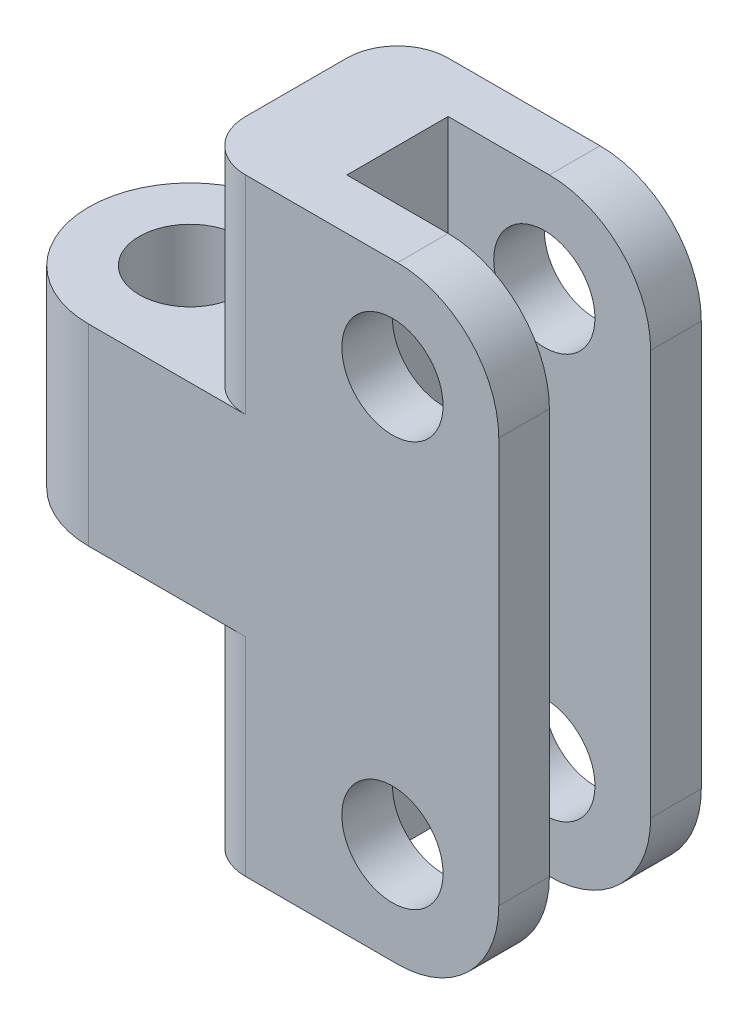
ISO-10303-21;
HEADER;
FILE_DESCRIPTION(('STEP AP214'),'2;1');
FILE_NAME('part.step','',(''),(''),'','','');
FILE_SCHEMA(('AUTOMOTIVE_DESIGN { 1 0 10303 214 1 1 1 1 }'));
ENDSEC;
DATA;
#1=APPLICATION_CONTEXT('core data for automotive mechanical design processes');
#2=APPLICATION_PROTOCOL_DEFINITION('international standard','automotive_design',2000,#1);
#3=PRODUCT_CONTEXT('',#1,'mechanical');
#4=PRODUCT('Part','Part','',(#3));
#5=PRODUCT_RELATED_PRODUCT_CATEGORY('part','',(#4));
#6=PRODUCT_DEFINITION_FORMATION('','',#4);
#7=PRODUCT_DEFINITION_CONTEXT('part definition',#1,'design');
#8=PRODUCT_DEFINITION('design','',#6,#7);
#9=PRODUCT_DEFINITION_SHAPE('','',#8);
#10=(LENGTH_UNIT() NAMED_UNIT(*) SI_UNIT(.MILLI.,.METRE.));
#11=(NAMED_UNIT(*) PLANE_ANGLE_UNIT() SI_UNIT($,.RADIAN.));
#12=(NAMED_UNIT(*) SI_UNIT($,.STERADIAN.) SOLID_ANGLE_UNIT());
#13=UNCERTAINTY_MEASURE_WITH_UNIT(LENGTH_MEASURE(1.E-05),#10,'distance_accuracy_value','');
#14=(GEOMETRIC_REPRESENTATION_CONTEXT(3) GLOBAL_UNCERTAINTY_ASSIGNED_CONTEXT((#13)) GLOBAL_UNIT_ASSIGNED_CONTEXT((#10,
#11,#12)) REPRESENTATION_CONTEXT('',''));
#15=CARTESIAN_POINT('',(0.,0.,0.));
#16=DIRECTION('',(0.,0.,1.));
#17=DIRECTION('',(1.,0.,0.));
#18=AXIS2_PLACEMENT_3D('',#15,#16,#17);
#19=CARTESIAN_POINT('',(0.,9.5,-10.));
#20=DIRECTION('',(0.,0.,-1.));
#21=DIRECTION('',(-1.,0.,0.));
#22=AXIS2_PLACEMENT_3D('',#19,#20,#21);
#23=PLANE('',#22);
#24=CARTESIAN_POINT('',(30.,20.,-10.));
#25=DIRECTION('',(0.,0.,1.));
#26=DIRECTION('',(1.,0.,0.));
#27=AXIS2_PLACEMENT_3D('',#24,#25,#26);
#28=CIRCLE('',#27,5.);
#29=CARTESIAN_POINT('',(35.,20.,-10.));
#30=VERTEX_POINT('',#29);
#31=EDGE_CURVE('E269',#30,#30,#28,.T.);
#32=ORIENTED_EDGE('',*,*,#31,.T.);
#33=EDGE_LOOP('',(#32));
#34=FACE_BOUND('',#33,.T.);
#35=CARTESIAN_POINT('',(30.,-20.,-10.));
#36=DIRECTION('',(0.,0.,1.));
#37=DIRECTION('',(1.,0.,0.));
#38=AXIS2_PLACEMENT_3D('',#35,#36,#37);
#39=CIRCLE('',#38,5.);
#40=CARTESIAN_POINT('',(35.,-20.,-10.));
#41=VERTEX_POINT('',#40);
#42=EDGE_CURVE('E633',#41,#41,#39,.T.);
#43=ORIENTED_EDGE('',*,*,#42,.T.);
#44=EDGE_LOOP('',(#43));
#45=FACE_BOUND('',#44,.T.);
#46=DIRECTION('',(1.,0.,0.));
#47=VECTOR('',#46,1.);
#48=CARTESIAN_POINT('',(0.,-30.,-10.));
#49=LINE('',#48,#47);
#50=CARTESIAN_POINT('',(15.5,-30.,-10.));
#51=VERTEX_POINT('',#50);
#52=CARTESIAN_POINT('',(30.5,-30.,-10.));
#53=VERTEX_POINT('',#52);
#54=EDGE_CURVE('E211',#51,#53,#49,.T.);
#55=ORIENTED_EDGE('',*,*,#54,.F.);
#56=DIRECTION('',(0.,-1.,0.));
#57=VECTOR('',#56,1.);
#58=CARTESIAN_POINT('',(15.5,-9.5,-10.));
#59=LINE('',#58,#57);
#60=CARTESIAN_POINT('',(15.5,-9.5,-10.));
#61=VERTEX_POINT('',#60);
#62=EDGE_CURVE('E318',#51,#61,#59,.F.);
#63=ORIENTED_EDGE('',*,*,#62,.T.);
#64=DIRECTION('',(1.,0.,0.));
#65=VECTOR('',#64,1.);
#66=CARTESIAN_POINT('',(0.,-9.5,-10.));
#67=LINE('',#66,#65);
#68=CARTESIAN_POINT('',(0.,-9.5,-10.));
#69=VERTEX_POINT('',#68);
#70=EDGE_CURVE('E251',#69,#61,#67,.T.);
#71=ORIENTED_EDGE('',*,*,#70,.F.);
#72=DIRECTION('',(0.,-1.,0.));
#73=VECTOR('',#72,1.);
#74=CARTESIAN_POINT('',(0.,9.5,-10.));
#75=LINE('',#74,#73);
#76=CARTESIAN_POINT('',(0.,9.5,-10.));
#77=VERTEX_POINT('',#76);
#78=EDGE_CURVE('E262',#77,#69,#75,.T.);
#79=ORIENTED_EDGE('',*,*,#78,.F.);
#80=DIRECTION('',(1.,0.,0.));
#81=VECTOR('',#80,1.);
#82=CARTESIAN_POINT('',(0.,9.5,-10.));
#83=LINE('',#82,#81);
#84=CARTESIAN_POINT('',(15.5,9.5,-10.));
#85=VERTEX_POINT('',#84);
#86=EDGE_CURVE('E238',#77,#85,#83,.T.);
#87=ORIENTED_EDGE('',*,*,#86,.T.);
#88=DIRECTION('',(0.,-1.,0.));
#89=VECTOR('',#88,1.);
#90=CARTESIAN_POINT('',(15.5,30.,-10.));
#91=LINE('',#90,#89);
#92=CARTESIAN_POINT('',(15.5,30.,-10.));
#93=VERTEX_POINT('',#92);
#94=EDGE_CURVE('E316',#85,#93,#91,.F.);
#95=ORIENTED_EDGE('',*,*,#94,.T.);
#96=DIRECTION('',(1.,0.,0.));
#97=VECTOR('',#96,1.);
#98=CARTESIAN_POINT('',(0.,30.,-10.));
#99=LINE('',#98,#97);
#100=CARTESIAN_POINT('',(30.5,30.,-10.));
#101=VERTEX_POINT('',#100);
#102=EDGE_CURVE('E349',#93,#101,#99,.T.);
#103=ORIENTED_EDGE('',*,*,#102,.T.);
#104=CARTESIAN_POINT('',(30.5,20.,-10.));
#105=DIRECTION('',(0.,0.,-1.));
#106=DIRECTION('',(-1.,0.,0.));
#107=AXIS2_PLACEMENT_3D('',#104,#105,#106);
#108=CIRCLE('',#107,10.);
#109=CARTESIAN_POINT('',(40.5,20.,-10.));
#110=VERTEX_POINT('',#109);
#111=EDGE_CURVE('E277',#101,#110,#108,.T.);
#112=ORIENTED_EDGE('',*,*,#111,.T.);
#113=DIRECTION('',(0.,-1.,0.));
#114=VECTOR('',#113,1.);
#115=CARTESIAN_POINT('',(40.5,30.,-10.));
#116=LINE('',#115,#114);
#117=CARTESIAN_POINT('',(40.5,-20.,-10.));
#118=VERTEX_POINT('',#117);
#119=EDGE_CURVE('E228',#110,#118,#116,.T.);
#120=ORIENTED_EDGE('',*,*,#119,.T.);
#121=CARTESIAN_POINT('',(30.5,-20.,-10.));
#122=DIRECTION('',(0.,0.,-1.));
#123=DIRECTION('',(-1.,0.,0.));
#124=AXIS2_PLACEMENT_3D('',#121,#122,#123);
#125=CIRCLE('',#124,10.);
#126=EDGE_CURVE('E279',#118,#53,#125,.T.);
#127=ORIENTED_EDGE('',*,*,#126,.T.);
#128=EDGE_LOOP('',(#55,#63,#71,#79,#87,#95,#103,#112,#120,#127));
#129=FACE_BOUND('',#128,.T.);
#130=ADVANCED_FACE('F40',(#34,#45,#129),#23,.T.);
#131=CARTESIAN_POINT('',(0.,9.5,0.));
#132=DIRECTION('',(0.,-1.,0.));
#133=DIRECTION('',(0.,0.,-1.));
#134=AXIS2_PLACEMENT_3D('',#131,#132,#133);
#135=CYLINDRICAL_SURFACE('',#134,10.);
#136=CARTESIAN_POINT('',(0.,-9.5,0.));
#137=DIRECTION('',(0.,1.,0.));
#138=DIRECTION('',(0.,0.,1.));
#139=AXIS2_PLACEMENT_3D('',#136,#137,#138);
#140=CIRCLE('',#139,10.);
#141=CARTESIAN_POINT('',(0.,-9.5,10.));
#142=VERTEX_POINT('',#141);
#143=EDGE_CURVE('E253',#69,#142,#140,.T.);
#144=ORIENTED_EDGE('',*,*,#143,.T.);
#145=DIRECTION('',(0.,-1.,0.));
#146=VECTOR('',#145,1.);
#147=CARTESIAN_POINT('',(0.,9.5,10.));
#148=LINE('',#147,#146);
#149=CARTESIAN_POINT('',(0.,9.5,10.));
#150=VERTEX_POINT('',#149);
#151=EDGE_CURVE('E248',#150,#142,#148,.T.);
#152=ORIENTED_EDGE('',*,*,#151,.F.);
#153=CARTESIAN_POINT('',(0.,9.5,0.));
#154=DIRECTION('',(0.,1.,0.));
#155=DIRECTION('',(0.,0.,1.));
#156=AXIS2_PLACEMENT_3D('',#153,#154,#155);
#157=CIRCLE('',#156,10.);
#158=EDGE_CURVE('E241',#77,#150,#157,.T.);
#159=ORIENTED_EDGE('',*,*,#158,.F.);
#160=ORIENTED_EDGE('',*,*,#78,.T.);
#161=EDGE_LOOP('',(#144,#152,#159,#160));
#162=FACE_BOUND('',#161,.T.);
#163=ADVANCED_FACE('F387',(#162),#135,.T.);
#164=CARTESIAN_POINT('',(0.,9.5,10.));
#165=DIRECTION('',(0.,0.,1.));
#166=DIRECTION('',(1.,0.,0.));
#167=AXIS2_PLACEMENT_3D('',#164,#165,#166);
#168=PLANE('',#167);
#169=CARTESIAN_POINT('',(30.,20.,10.));
#170=DIRECTION('',(0.,0.,1.));
#171=DIRECTION('',(1.,0.,0.));
#172=AXIS2_PLACEMENT_3D('',#169,#170,#171);
#173=CIRCLE('',#172,5.);
#174=CARTESIAN_POINT('',(35.,20.,10.));
#175=VERTEX_POINT('',#174);
#176=EDGE_CURVE('E636',#175,#175,#173,.T.);
#177=ORIENTED_EDGE('',*,*,#176,.F.);
#178=EDGE_LOOP('',(#177));
#179=FACE_BOUND('',#178,.T.);
#180=CARTESIAN_POINT('',(30.,-20.,10.));
#181=DIRECTION('',(0.,0.,1.));
#182=DIRECTION('',(1.,0.,0.));
#183=AXIS2_PLACEMENT_3D('',#180,#181,#182);
#184=CIRCLE('',#183,5.);
#185=CARTESIAN_POINT('',(35.,-20.,10.));
#186=VERTEX_POINT('',#185);
#187=EDGE_CURVE('E629',#186,#186,#184,.T.);
#188=ORIENTED_EDGE('',*,*,#187,.F.);
#189=EDGE_LOOP('',(#188));
#190=FACE_BOUND('',#189,.T.);
#191=DIRECTION('',(-1.,0.,0.));
#192=VECTOR('',#191,1.);
#193=CARTESIAN_POINT('',(0.,-9.5,10.));
#194=LINE('',#193,#192);
#195=CARTESIAN_POINT('',(15.5,-9.5,10.));
#196=VERTEX_POINT('',#195);
#197=EDGE_CURVE('E256',#196,#142,#194,.T.);
#198=ORIENTED_EDGE('',*,*,#197,.F.);
#199=DIRECTION('',(0.,-1.,0.));
#200=VECTOR('',#199,1.);
#201=CARTESIAN_POINT('',(15.5,-30.,10.));
#202=LINE('',#201,#200);
#203=CARTESIAN_POINT('',(15.5,-30.,10.));
#204=VERTEX_POINT('',#203);
#205=EDGE_CURVE('E324',#196,#204,#202,.T.);
#206=ORIENTED_EDGE('',*,*,#205,.T.);
#207=DIRECTION('',(-1.,0.,0.));
#208=VECTOR('',#207,1.);
#209=CARTESIAN_POINT('',(0.,-30.,10.));
#210=LINE('',#209,#208);
#211=CARTESIAN_POINT('',(30.5,-30.,10.));
#212=VERTEX_POINT('',#211);
#213=EDGE_CURVE('E217',#212,#204,#210,.T.);
#214=ORIENTED_EDGE('',*,*,#213,.F.);
#215=CARTESIAN_POINT('',(30.5,-20.,10.));
#216=DIRECTION('',(0.,0.,1.));
#217=DIRECTION('',(1.,0.,0.));
#218=AXIS2_PLACEMENT_3D('',#215,#216,#217);
#219=CIRCLE('',#218,10.);
#220=CARTESIAN_POINT('',(40.5,-20.,10.));
#221=VERTEX_POINT('',#220);
#222=EDGE_CURVE('E301',#212,#221,#219,.T.);
#223=ORIENTED_EDGE('',*,*,#222,.T.);
#224=DIRECTION('',(0.,-1.,0.));
#225=VECTOR('',#224,1.);
#226=CARTESIAN_POINT('',(40.5,30.,10.));
#227=LINE('',#226,#225);
#228=CARTESIAN_POINT('',(40.5,20.,10.));
#229=VERTEX_POINT('',#228);
#230=EDGE_CURVE('E225',#229,#221,#227,.T.);
#231=ORIENTED_EDGE('',*,*,#230,.F.);
#232=CARTESIAN_POINT('',(30.5,20.,10.));
#233=DIRECTION('',(0.,0.,1.));
#234=DIRECTION('',(1.,0.,0.));
#235=AXIS2_PLACEMENT_3D('',#232,#233,#234);
#236=CIRCLE('',#235,10.);
#237=CARTESIAN_POINT('',(30.5,30.,10.));
#238=VERTEX_POINT('',#237);
#239=EDGE_CURVE('E299',#229,#238,#236,.T.);
#240=ORIENTED_EDGE('',*,*,#239,.T.);
#241=DIRECTION('',(-1.,0.,0.));
#242=VECTOR('',#241,1.);
#243=CARTESIAN_POINT('',(0.,30.,10.));
#244=LINE('',#243,#242);
#245=CARTESIAN_POINT('',(15.5,30.,10.));
#246=VERTEX_POINT('',#245);
#247=EDGE_CURVE('E188',#238,#246,#244,.T.);
#248=ORIENTED_EDGE('',*,*,#247,.T.);
#249=DIRECTION('',(0.,-1.,0.));
#250=VECTOR('',#249,1.);
#251=CARTESIAN_POINT('',(15.5,9.5,10.));
#252=LINE('',#251,#250);
#253=CARTESIAN_POINT('',(15.5,9.5,10.));
#254=VERTEX_POINT('',#253);
#255=EDGE_CURVE('E321',#246,#254,#252,.T.);
#256=ORIENTED_EDGE('',*,*,#255,.T.);
#257=DIRECTION('',(-1.,0.,0.));
#258=VECTOR('',#257,1.);
#259=CARTESIAN_POINT('',(0.,9.5,10.));
#260=LINE('',#259,#258);
#261=EDGE_CURVE('E243',#254,#150,#260,.T.);
#262=ORIENTED_EDGE('',*,*,#261,.T.);
#263=ORIENTED_EDGE('',*,*,#151,.T.);
#264=EDGE_LOOP('',(#198,#206,#214,#223,#231,#240,#248,#256,#262,#263));
#265=FACE_BOUND('',#264,.T.);
#266=ADVANCED_FACE('F360',(#179,#190,#265),#168,.T.);
#267=CARTESIAN_POINT('',(0.,9.5,0.));
#268=DIRECTION('',(0.,-1.,0.));
#269=DIRECTION('',(0.,0.,-1.));
#270=AXIS2_PLACEMENT_3D('',#267,#268,#269);
#271=CYLINDRICAL_SURFACE('',#270,5.);
#272=CARTESIAN_POINT('',(0.,9.5,0.));
#273=DIRECTION('',(0.,1.,0.));
#274=DIRECTION('',(0.,0.,1.));
#275=AXIS2_PLACEMENT_3D('',#272,#273,#274);
#276=CIRCLE('',#275,5.);
#277=CARTESIAN_POINT('',(0.,9.5,5.));
#278=VERTEX_POINT('',#277);
#279=EDGE_CURVE('E235',#278,#278,#276,.T.);
#280=ORIENTED_EDGE('',*,*,#279,.T.);
#281=EDGE_LOOP('',(#280));
#282=FACE_BOUND('',#281,.T.);
#283=CARTESIAN_POINT('',(0.,-9.5,0.));
#284=DIRECTION('',(0.,1.,0.));
#285=DIRECTION('',(0.,0.,1.));
#286=AXIS2_PLACEMENT_3D('',#283,#284,#285);
#287=CIRCLE('',#286,5.);
#288=CARTESIAN_POINT('',(0.,-9.5,5.));
#289=VERTEX_POINT('',#288);
#290=EDGE_CURVE('E234',#289,#289,#287,.T.);
#291=ORIENTED_EDGE('',*,*,#290,.F.);
#292=EDGE_LOOP('',(#291));
#293=FACE_BOUND('',#292,.T.);
#294=ADVANCED_FACE('F399',(#282,#293),#271,.F.);
#295=CARTESIAN_POINT('',(0.,9.5,0.));
#296=DIRECTION('',(0.,1.,0.));
#297=DIRECTION('',(0.,0.,1.));
#298=AXIS2_PLACEMENT_3D('',#295,#296,#297);
#299=PLANE('',#298);
#300=ORIENTED_EDGE('',*,*,#279,.F.);
#301=EDGE_LOOP('',(#300));
#302=FACE_BOUND('',#301,.T.);
#303=ORIENTED_EDGE('',*,*,#86,.F.);
#304=ORIENTED_EDGE('',*,*,#158,.T.);
#305=ORIENTED_EDGE('',*,*,#261,.F.);
#306=CARTESIAN_POINT('',(15.5,9.5,5.));
#307=DIRECTION('',(0.,1.,0.));
#308=DIRECTION('',(0.,0.,1.));
#309=AXIS2_PLACEMENT_3D('',#306,#307,#308);
#310=CIRCLE('',#309,5.);
#311=CARTESIAN_POINT('',(10.5,9.5,5.));
#312=VERTEX_POINT('',#311);
#313=EDGE_CURVE('E11',#254,#312,#310,.F.);
#314=ORIENTED_EDGE('',*,*,#313,.T.);
#315=DIRECTION('',(0.,0.,1.));
#316=VECTOR('',#315,1.);
#317=CARTESIAN_POINT('',(10.5,9.5,0.));
#318=LINE('',#317,#316);
#319=CARTESIAN_POINT('',(10.5,9.5,-5.));
#320=VERTEX_POINT('',#319);
#321=EDGE_CURVE('E246',#320,#312,#318,.T.);
#322=ORIENTED_EDGE('',*,*,#321,.F.);
#323=CARTESIAN_POINT('',(15.5,9.5,-5.));
#324=DIRECTION('',(0.,1.,0.));
#325=DIRECTION('',(0.,0.,1.));
#326=AXIS2_PLACEMENT_3D('',#323,#324,#325);
#327=CIRCLE('',#326,5.);
#328=EDGE_CURVE('E48',#320,#85,#327,.F.);
#329=ORIENTED_EDGE('',*,*,#328,.T.);
#330=EDGE_LOOP('',(#303,#304,#305,#314,#322,#329));
#331=FACE_BOUND('',#330,.T.);
#332=ADVANCED_FACE('F343',(#302,#331),#299,.T.);
#333=CARTESIAN_POINT('',(0.,-9.5,0.));
#334=DIRECTION('',(0.,1.,0.));
#335=DIRECTION('',(0.,0.,1.));
#336=AXIS2_PLACEMENT_3D('',#333,#334,#335);
#337=PLANE('',#336);
#338=ORIENTED_EDGE('',*,*,#290,.T.);
#339=EDGE_LOOP('',(#338));
#340=FACE_BOUND('',#339,.T.);
#341=ORIENTED_EDGE('',*,*,#70,.T.);
#342=CARTESIAN_POINT('',(15.5,-9.5,-5.));
#343=DIRECTION('',(0.,1.,0.));
#344=DIRECTION('',(0.,0.,1.));
#345=AXIS2_PLACEMENT_3D('',#342,#343,#344);
#346=CIRCLE('',#345,5.);
#347=CARTESIAN_POINT('',(10.5,-9.5,-5.));
#348=VERTEX_POINT('',#347);
#349=EDGE_CURVE('E334',#61,#348,#346,.T.);
#350=ORIENTED_EDGE('',*,*,#349,.T.);
#351=DIRECTION('',(0.,0.,1.));
#352=VECTOR('',#351,1.);
#353=CARTESIAN_POINT('',(10.5,-9.5,0.));
#354=LINE('',#353,#352);
#355=CARTESIAN_POINT('',(10.5,-9.5,5.));
#356=VERTEX_POINT('',#355);
#357=EDGE_CURVE('E239',#348,#356,#354,.T.);
#358=ORIENTED_EDGE('',*,*,#357,.T.);
#359=CARTESIAN_POINT('',(15.5,-9.5,5.));
#360=DIRECTION('',(0.,1.,0.));
#361=DIRECTION('',(0.,0.,1.));
#362=AXIS2_PLACEMENT_3D('',#359,#360,#361);
#363=CIRCLE('',#362,5.);
#364=EDGE_CURVE('E336',#356,#196,#363,.T.);
#365=ORIENTED_EDGE('',*,*,#364,.T.);
#366=ORIENTED_EDGE('',*,*,#197,.T.);
#367=ORIENTED_EDGE('',*,*,#143,.F.);
#368=EDGE_LOOP('',(#341,#350,#358,#365,#366,#367));
#369=FACE_BOUND('',#368,.T.);
#370=ADVANCED_FACE('F369',(#340,#369),#337,.F.);
#371=CARTESIAN_POINT('',(10.5,30.,0.));
#372=DIRECTION('',(1.,0.,0.));
#373=DIRECTION('',(0.,0.,-1.));
#374=AXIS2_PLACEMENT_3D('',#371,#372,#373);
#375=PLANE('',#374);
#376=DIRECTION('',(0.,0.,1.));
#377=VECTOR('',#376,1.);
#378=CARTESIAN_POINT('',(10.5,30.,0.));
#379=LINE('',#378,#377);
#380=CARTESIAN_POINT('',(10.5,30.,-5.));
#381=VERTEX_POINT('',#380);
#382=CARTESIAN_POINT('',(10.5,30.,5.));
#383=VERTEX_POINT('',#382);
#384=EDGE_CURVE('E352',#381,#383,#379,.T.);
#385=ORIENTED_EDGE('',*,*,#384,.F.);
#386=DIRECTION('',(0.,-1.,0.));
#387=VECTOR('',#386,1.);
#388=CARTESIAN_POINT('',(10.5,9.5,-5.));
#389=LINE('',#388,#387);
#390=EDGE_CURVE('E328',#381,#320,#389,.T.);
#391=ORIENTED_EDGE('',*,*,#390,.T.);
#392=ORIENTED_EDGE('',*,*,#321,.T.);
#393=DIRECTION('',(0.,-1.,0.));
#394=VECTOR('',#393,1.);
#395=CARTESIAN_POINT('',(10.5,30.,5.));
#396=LINE('',#395,#394);
#397=EDGE_CURVE('E55',#312,#383,#396,.F.);
#398=ORIENTED_EDGE('',*,*,#397,.T.);
#399=EDGE_LOOP('',(#385,#391,#392,#398));
#400=FACE_BOUND('',#399,.T.);
#401=ADVANCED_FACE('F366',(#400),#375,.F.);
#402=CARTESIAN_POINT('',(0.,30.,-5.));
#403=DIRECTION('',(0.,0.,-1.));
#404=DIRECTION('',(-1.,0.,0.));
#405=AXIS2_PLACEMENT_3D('',#402,#403,#404);
#406=PLANE('',#405);
#407=CARTESIAN_POINT('',(30.,20.,-5.));
#408=DIRECTION('',(0.,0.,-1.));
#409=DIRECTION('',(-1.,0.,0.));
#410=AXIS2_PLACEMENT_3D('',#407,#408,#409);
#411=CIRCLE('',#410,5.);
#412=CARTESIAN_POINT('',(25.,20.,-5.));
#413=VERTEX_POINT('',#412);
#414=EDGE_CURVE('E212',#413,#413,#411,.T.);
#415=ORIENTED_EDGE('',*,*,#414,.T.);
#416=EDGE_LOOP('',(#415));
#417=FACE_BOUND('',#416,.T.);
#418=CARTESIAN_POINT('',(30.,-20.,-5.));
#419=DIRECTION('',(0.,0.,-1.));
#420=DIRECTION('',(-1.,0.,0.));
#421=AXIS2_PLACEMENT_3D('',#418,#419,#420);
#422=CIRCLE('',#421,5.);
#423=CARTESIAN_POINT('',(25.,-20.,-5.));
#424=VERTEX_POINT('',#423);
#425=EDGE_CURVE('E268',#424,#424,#422,.T.);
#426=ORIENTED_EDGE('',*,*,#425,.T.);
#427=EDGE_LOOP('',(#426));
#428=FACE_BOUND('',#427,.T.);
#429=DIRECTION('',(1.,0.,0.));
#430=VECTOR('',#429,1.);
#431=CARTESIAN_POINT('',(0.,-30.,-5.));
#432=LINE('',#431,#430);
#433=CARTESIAN_POINT('',(20.5,-30.,-5.));
#434=VERTEX_POINT('',#433);
#435=CARTESIAN_POINT('',(30.5,-30.,-5.));
#436=VERTEX_POINT('',#435);
#437=EDGE_CURVE('E208',#434,#436,#432,.T.);
#438=ORIENTED_EDGE('',*,*,#437,.T.);
#439=CARTESIAN_POINT('',(30.5,-20.,-5.));
#440=DIRECTION('',(0.,0.,-1.));
#441=DIRECTION('',(-1.,0.,0.));
#442=AXIS2_PLACEMENT_3D('',#439,#440,#441);
#443=CIRCLE('',#442,10.);
#444=CARTESIAN_POINT('',(40.5,-20.,-5.));
#445=VERTEX_POINT('',#444);
#446=EDGE_CURVE('E288',#436,#445,#443,.F.);
#447=ORIENTED_EDGE('',*,*,#446,.T.);
#448=DIRECTION('',(0.,-1.,0.));
#449=VECTOR('',#448,1.);
#450=CARTESIAN_POINT('',(40.5,30.,-5.));
#451=LINE('',#450,#449);
#452=CARTESIAN_POINT('',(40.5,20.,-5.));
#453=VERTEX_POINT('',#452);
#454=EDGE_CURVE('E231',#453,#445,#451,.T.);
#455=ORIENTED_EDGE('',*,*,#454,.F.);
#456=CARTESIAN_POINT('',(30.5,20.,-5.));
#457=DIRECTION('',(0.,0.,-1.));
#458=DIRECTION('',(-1.,0.,0.));
#459=AXIS2_PLACEMENT_3D('',#456,#457,#458);
#460=CIRCLE('',#459,10.);
#461=CARTESIAN_POINT('',(30.5,30.,-5.));
#462=VERTEX_POINT('',#461);
#463=EDGE_CURVE('E286',#453,#462,#460,.F.);
#464=ORIENTED_EDGE('',*,*,#463,.T.);
#465=DIRECTION('',(1.,0.,0.));
#466=VECTOR('',#465,1.);
#467=CARTESIAN_POINT('',(0.,30.,-5.));
#468=LINE('',#467,#466);
#469=CARTESIAN_POINT('',(20.5,30.,-5.));
#470=VERTEX_POINT('',#469);
#471=EDGE_CURVE('E222',#470,#462,#468,.T.);
#472=ORIENTED_EDGE('',*,*,#471,.F.);
#473=DIRECTION('',(0.,-1.,0.));
#474=VECTOR('',#473,1.);
#475=CARTESIAN_POINT('',(20.5,30.,-5.));
#476=LINE('',#475,#474);
#477=EDGE_CURVE('E199',#470,#434,#476,.T.);
#478=ORIENTED_EDGE('',*,*,#477,.T.);
#479=EDGE_LOOP('',(#438,#447,#455,#464,#472,#478));
#480=FACE_BOUND('',#479,.T.);
#481=ADVANCED_FACE('F368',(#417,#428,#480),#406,.F.);
#482=CARTESIAN_POINT('',(40.5,30.,0.));
#483=DIRECTION('',(-1.,0.,0.));
#484=DIRECTION('',(0.,0.,1.));
#485=AXIS2_PLACEMENT_3D('',#482,#483,#484);
#486=PLANE('',#485);
#487=ORIENTED_EDGE('',*,*,#454,.T.);
#488=DIRECTION('',(0.,0.,-1.));
#489=VECTOR('',#488,1.);
#490=CARTESIAN_POINT('',(40.5,-20.,0.));
#491=LINE('',#490,#489);
#492=EDGE_CURVE('E274',#445,#118,#491,.T.);
#493=ORIENTED_EDGE('',*,*,#492,.T.);
#494=ORIENTED_EDGE('',*,*,#119,.F.);
#495=DIRECTION('',(0.,0.,-1.));
#496=VECTOR('',#495,1.);
#497=CARTESIAN_POINT('',(40.5,20.,-5.));
#498=LINE('',#497,#496);
#499=EDGE_CURVE('E264',#110,#453,#498,.F.);
#500=ORIENTED_EDGE('',*,*,#499,.T.);
#501=EDGE_LOOP('',(#487,#493,#494,#500));
#502=FACE_BOUND('',#501,.T.);
#503=ADVANCED_FACE('F376',(#502),#486,.F.);
#504=ORIENTED_EDGE('',*,*,#357,.F.);
#505=DIRECTION('',(0.,-1.,0.));
#506=VECTOR('',#505,1.);
#507=CARTESIAN_POINT('',(10.5,-30.,-5.));
#508=LINE('',#507,#506);
#509=CARTESIAN_POINT('',(10.5,-30.,-5.));
#510=VERTEX_POINT('',#509);
#511=EDGE_CURVE('E309',#348,#510,#508,.T.);
#512=ORIENTED_EDGE('',*,*,#511,.T.);
#513=DIRECTION('',(0.,0.,1.));
#514=VECTOR('',#513,1.);
#515=CARTESIAN_POINT('',(10.5,-30.,0.));
#516=LINE('',#515,#514);
#517=CARTESIAN_POINT('',(10.5,-30.,5.));
#518=VERTEX_POINT('',#517);
#519=EDGE_CURVE('E214',#510,#518,#516,.T.);
#520=ORIENTED_EDGE('',*,*,#519,.T.);
#521=DIRECTION('',(0.,-1.,0.));
#522=VECTOR('',#521,1.);
#523=CARTESIAN_POINT('',(10.5,-9.5,5.));
#524=LINE('',#523,#522);
#525=EDGE_CURVE('E307',#518,#356,#524,.F.);
#526=ORIENTED_EDGE('',*,*,#525,.T.);
#527=EDGE_LOOP('',(#504,#512,#520,#526));
#528=FACE_BOUND('',#527,.T.);
#529=ADVANCED_FACE('F371',(#528),#375,.F.);
#530=CARTESIAN_POINT('',(40.5,30.,0.));
#531=DIRECTION('',(-1.,0.,0.));
#532=DIRECTION('',(0.,0.,1.));
#533=AXIS2_PLACEMENT_3D('',#530,#531,#532);
#534=PLANE('',#533);
#535=ORIENTED_EDGE('',*,*,#230,.T.);
#536=DIRECTION('',(0.,0.,-1.));
#537=VECTOR('',#536,1.);
#538=CARTESIAN_POINT('',(40.5,-20.,0.));
#539=LINE('',#538,#537);
#540=CARTESIAN_POINT('',(40.5,-20.,5.));
#541=VERTEX_POINT('',#540);
#542=EDGE_CURVE('E292',#221,#541,#539,.T.);
#543=ORIENTED_EDGE('',*,*,#542,.T.);
#544=DIRECTION('',(0.,-1.,0.));
#545=VECTOR('',#544,1.);
#546=CARTESIAN_POINT('',(40.5,30.,5.));
#547=LINE('',#546,#545);
#548=CARTESIAN_POINT('',(40.5,20.,5.));
#549=VERTEX_POINT('',#548);
#550=EDGE_CURVE('E198',#549,#541,#547,.T.);
#551=ORIENTED_EDGE('',*,*,#550,.F.);
#552=DIRECTION('',(0.,0.,-1.));
#553=VECTOR('',#552,1.);
#554=CARTESIAN_POINT('',(40.5,20.,10.));
#555=LINE('',#554,#553);
#556=EDGE_CURVE('E290',#549,#229,#555,.F.);
#557=ORIENTED_EDGE('',*,*,#556,.T.);
#558=EDGE_LOOP('',(#535,#543,#551,#557));
#559=FACE_BOUND('',#558,.T.);
#560=ADVANCED_FACE('F384',(#559),#534,.F.);
#561=CARTESIAN_POINT('',(0.,30.,5.));
#562=DIRECTION('',(0.,0.,1.));
#563=DIRECTION('',(1.,0.,0.));
#564=AXIS2_PLACEMENT_3D('',#561,#562,#563);
#565=PLANE('',#564);
#566=CARTESIAN_POINT('',(30.,20.,5.));
#567=DIRECTION('',(0.,0.,1.));
#568=DIRECTION('',(1.,0.,0.));
#569=AXIS2_PLACEMENT_3D('',#566,#567,#568);
#570=CIRCLE('',#569,5.);
#571=CARTESIAN_POINT('',(35.,20.,5.));
#572=VERTEX_POINT('',#571);
#573=EDGE_CURVE('E270',#572,#572,#570,.T.);
#574=ORIENTED_EDGE('',*,*,#573,.T.);
#575=EDGE_LOOP('',(#574));
#576=FACE_BOUND('',#575,.T.);
#577=CARTESIAN_POINT('',(30.,-20.,5.));
#578=DIRECTION('',(0.,0.,1.));
#579=DIRECTION('',(1.,0.,0.));
#580=AXIS2_PLACEMENT_3D('',#577,#578,#579);
#581=CIRCLE('',#580,5.);
#582=CARTESIAN_POINT('',(35.,-20.,5.));
#583=VERTEX_POINT('',#582);
#584=EDGE_CURVE('E265',#583,#583,#581,.T.);
#585=ORIENTED_EDGE('',*,*,#584,.T.);
#586=EDGE_LOOP('',(#585));
#587=FACE_BOUND('',#586,.T.);
#588=ORIENTED_EDGE('',*,*,#550,.T.);
#589=CARTESIAN_POINT('',(30.5,-20.,5.));
#590=DIRECTION('',(0.,0.,1.));
#591=DIRECTION('',(1.,0.,0.));
#592=AXIS2_PLACEMENT_3D('',#589,#590,#591);
#593=CIRCLE('',#592,10.);
#594=CARTESIAN_POINT('',(30.5,-30.,5.));
#595=VERTEX_POINT('',#594);
#596=EDGE_CURVE('E297',#541,#595,#593,.F.);
#597=ORIENTED_EDGE('',*,*,#596,.T.);
#598=DIRECTION('',(-1.,0.,0.));
#599=VECTOR('',#598,1.);
#600=CARTESIAN_POINT('',(0.,-30.,5.));
#601=LINE('',#600,#599);
#602=CARTESIAN_POINT('',(20.5,-30.,5.));
#603=VERTEX_POINT('',#602);
#604=EDGE_CURVE('E195',#595,#603,#601,.T.);
#605=ORIENTED_EDGE('',*,*,#604,.T.);
#606=DIRECTION('',(0.,-1.,0.));
#607=VECTOR('',#606,1.);
#608=CARTESIAN_POINT('',(20.5,30.,5.));
#609=LINE('',#608,#607);
#610=CARTESIAN_POINT('',(20.5,30.,5.));
#611=VERTEX_POINT('',#610);
#612=EDGE_CURVE('E191',#611,#603,#609,.T.);
#613=ORIENTED_EDGE('',*,*,#612,.F.);
#614=DIRECTION('',(-1.,0.,0.));
#615=VECTOR('',#614,1.);
#616=CARTESIAN_POINT('',(0.,30.,5.));
#617=LINE('',#616,#615);
#618=CARTESIAN_POINT('',(30.5,30.,5.));
#619=VERTEX_POINT('',#618);
#620=EDGE_CURVE('E177',#619,#611,#617,.T.);
#621=ORIENTED_EDGE('',*,*,#620,.F.);
#622=CARTESIAN_POINT('',(30.5,20.,5.));
#623=DIRECTION('',(0.,0.,1.));
#624=DIRECTION('',(1.,0.,0.));
#625=AXIS2_PLACEMENT_3D('',#622,#623,#624);
#626=CIRCLE('',#625,10.);
#627=EDGE_CURVE('E295',#619,#549,#626,.F.);
#628=ORIENTED_EDGE('',*,*,#627,.T.);
#629=EDGE_LOOP('',(#588,#597,#605,#613,#621,#628));
#630=FACE_BOUND('',#629,.T.);
#631=ADVANCED_FACE('F193',(#576,#587,#630),#565,.F.);
#632=CARTESIAN_POINT('',(20.5,30.,0.));
#633=DIRECTION('',(-1.,0.,0.));
#634=DIRECTION('',(0.,0.,1.));
#635=AXIS2_PLACEMENT_3D('',#632,#633,#634);
#636=PLANE('',#635);
#637=DIRECTION('',(0.,0.,-1.));
#638=VECTOR('',#637,1.);
#639=CARTESIAN_POINT('',(20.5,-30.,0.));
#640=LINE('',#639,#638);
#641=EDGE_CURVE('E221',#603,#434,#640,.T.);
#642=ORIENTED_EDGE('',*,*,#641,.T.);
#643=ORIENTED_EDGE('',*,*,#477,.F.);
#644=DIRECTION('',(0.,0.,-1.));
#645=VECTOR('',#644,1.);
#646=CARTESIAN_POINT('',(20.5,30.,0.));
#647=LINE('',#646,#645);
#648=EDGE_CURVE('E182',#611,#470,#647,.T.);
#649=ORIENTED_EDGE('',*,*,#648,.F.);
#650=ORIENTED_EDGE('',*,*,#612,.T.);
#651=EDGE_LOOP('',(#642,#643,#649,#650));
#652=FACE_BOUND('',#651,.T.);
#653=ADVANCED_FACE('F201',(#652),#636,.F.);
#654=CARTESIAN_POINT('',(0.,30.,0.));
#655=DIRECTION('',(0.,1.,0.));
#656=DIRECTION('',(0.,0.,1.));
#657=AXIS2_PLACEMENT_3D('',#654,#655,#656);
#658=PLANE('',#657);
#659=ORIENTED_EDGE('',*,*,#102,.F.);
#660=CARTESIAN_POINT('',(15.5,30.,-5.));
#661=DIRECTION('',(0.,1.,0.));
#662=DIRECTION('',(0.,0.,1.));
#663=AXIS2_PLACEMENT_3D('',#660,#661,#662);
#664=CIRCLE('',#663,5.);
#665=EDGE_CURVE('E62',#93,#381,#664,.T.);
#666=ORIENTED_EDGE('',*,*,#665,.T.);
#667=ORIENTED_EDGE('',*,*,#384,.T.);
#668=CARTESIAN_POINT('',(15.5,30.,5.));
#669=DIRECTION('',(0.,1.,0.));
#670=DIRECTION('',(0.,0.,1.));
#671=AXIS2_PLACEMENT_3D('',#668,#669,#670);
#672=CIRCLE('',#671,5.);
#673=EDGE_CURVE('E331',#383,#246,#672,.T.);
#674=ORIENTED_EDGE('',*,*,#673,.T.);
#675=ORIENTED_EDGE('',*,*,#247,.F.);
#676=DIRECTION('',(0.,0.,-1.));
#677=VECTOR('',#676,1.);
#678=CARTESIAN_POINT('',(30.5,30.,5.));
#679=LINE('',#678,#677);
#680=EDGE_CURVE('E186',#238,#619,#679,.T.);
#681=ORIENTED_EDGE('',*,*,#680,.T.);
#682=ORIENTED_EDGE('',*,*,#620,.T.);
#683=ORIENTED_EDGE('',*,*,#648,.T.);
#684=ORIENTED_EDGE('',*,*,#471,.T.);
#685=DIRECTION('',(0.,0.,-1.));
#686=VECTOR('',#685,1.);
#687=CARTESIAN_POINT('',(30.5,30.,-10.));
#688=LINE('',#687,#686);
#689=EDGE_CURVE('E304',#462,#101,#688,.T.);
#690=ORIENTED_EDGE('',*,*,#689,.T.);
#691=EDGE_LOOP('',(#659,#666,#667,#674,#675,#681,#682,#683,#684,#690));
#692=FACE_BOUND('',#691,.T.);
#693=ADVANCED_FACE('F179',(#692),#658,.T.);
#694=CARTESIAN_POINT('',(0.,-30.,0.));
#695=DIRECTION('',(0.,1.,0.));
#696=DIRECTION('',(0.,0.,1.));
#697=AXIS2_PLACEMENT_3D('',#694,#695,#696);
#698=PLANE('',#697);
#699=ORIENTED_EDGE('',*,*,#519,.F.);
#700=CARTESIAN_POINT('',(15.5,-30.,-5.));
#701=DIRECTION('',(0.,1.,0.));
#702=DIRECTION('',(0.,0.,1.));
#703=AXIS2_PLACEMENT_3D('',#700,#701,#702);
#704=CIRCLE('',#703,5.);
#705=EDGE_CURVE('E314',#510,#51,#704,.F.);
#706=ORIENTED_EDGE('',*,*,#705,.T.);
#707=ORIENTED_EDGE('',*,*,#54,.T.);
#708=DIRECTION('',(0.,0.,-1.));
#709=VECTOR('',#708,1.);
#710=CARTESIAN_POINT('',(30.5,-30.,0.));
#711=LINE('',#710,#709);
#712=EDGE_CURVE('E284',#53,#436,#711,.F.);
#713=ORIENTED_EDGE('',*,*,#712,.T.);
#714=ORIENTED_EDGE('',*,*,#437,.F.);
#715=ORIENTED_EDGE('',*,*,#641,.F.);
#716=ORIENTED_EDGE('',*,*,#604,.F.);
#717=DIRECTION('',(0.,0.,-1.));
#718=VECTOR('',#717,1.);
#719=CARTESIAN_POINT('',(30.5,-30.,0.));
#720=LINE('',#719,#718);
#721=EDGE_CURVE('E282',#595,#212,#720,.F.);
#722=ORIENTED_EDGE('',*,*,#721,.T.);
#723=ORIENTED_EDGE('',*,*,#213,.T.);
#724=CARTESIAN_POINT('',(15.5,-30.,5.));
#725=DIRECTION('',(0.,1.,0.));
#726=DIRECTION('',(0.,0.,1.));
#727=AXIS2_PLACEMENT_3D('',#724,#725,#726);
#728=CIRCLE('',#727,5.);
#729=EDGE_CURVE('E312',#204,#518,#728,.F.);
#730=ORIENTED_EDGE('',*,*,#729,.T.);
#731=EDGE_LOOP('',(#699,#706,#707,#713,#714,#715,#716,#722,#723,#730));
#732=FACE_BOUND('',#731,.T.);
#733=ADVANCED_FACE('F455',(#732),#698,.F.);
#734=CARTESIAN_POINT('',(30.,-20.,-10.));
#735=DIRECTION('',(0.,0.,1.));
#736=DIRECTION('',(1.,0.,0.));
#737=AXIS2_PLACEMENT_3D('',#734,#735,#736);
#738=CYLINDRICAL_SURFACE('',#737,5.);
#739=ORIENTED_EDGE('',*,*,#187,.T.);
#740=EDGE_LOOP('',(#739));
#741=FACE_BOUND('',#740,.T.);
#742=ORIENTED_EDGE('',*,*,#584,.F.);
#743=EDGE_LOOP('',(#742));
#744=FACE_BOUND('',#743,.T.);
#745=ADVANCED_FACE('F460',(#741,#744),#738,.F.);
#746=CARTESIAN_POINT('',(30.,20.,-10.));
#747=DIRECTION('',(0.,0.,1.));
#748=DIRECTION('',(1.,0.,0.));
#749=AXIS2_PLACEMENT_3D('',#746,#747,#748);
#750=CYLINDRICAL_SURFACE('',#749,5.);
#751=ORIENTED_EDGE('',*,*,#176,.T.);
#752=EDGE_LOOP('',(#751));
#753=FACE_BOUND('',#752,.T.);
#754=ORIENTED_EDGE('',*,*,#573,.F.);
#755=EDGE_LOOP('',(#754));
#756=FACE_BOUND('',#755,.T.);
#757=ADVANCED_FACE('F579',(#753,#756),#750,.F.);
#758=ORIENTED_EDGE('',*,*,#42,.F.);
#759=EDGE_LOOP('',(#758));
#760=FACE_BOUND('',#759,.T.);
#761=ORIENTED_EDGE('',*,*,#425,.F.);
#762=EDGE_LOOP('',(#761));
#763=FACE_BOUND('',#762,.T.);
#764=ADVANCED_FACE('F576',(#760,#763),#738,.F.);
#765=ORIENTED_EDGE('',*,*,#31,.F.);
#766=EDGE_LOOP('',(#765));
#767=FACE_BOUND('',#766,.T.);
#768=ORIENTED_EDGE('',*,*,#414,.F.);
#769=EDGE_LOOP('',(#768));
#770=FACE_BOUND('',#769,.T.);
#771=ADVANCED_FACE('F407',(#767,#770),#750,.F.);
#772=CARTESIAN_POINT('',(30.5,-20.,0.));
#773=DIRECTION('',(0.,0.,-1.));
#774=DIRECTION('',(-1.,0.,0.));
#775=AXIS2_PLACEMENT_3D('',#772,#773,#774);
#776=CYLINDRICAL_SURFACE('',#775,10.);
#777=ORIENTED_EDGE('',*,*,#446,.F.);
#778=ORIENTED_EDGE('',*,*,#712,.F.);
#779=ORIENTED_EDGE('',*,*,#126,.F.);
#780=ORIENTED_EDGE('',*,*,#492,.F.);
#781=EDGE_LOOP('',(#777,#778,#779,#780));
#782=FACE_BOUND('',#781,.T.);
#783=ADVANCED_FACE('F403',(#782),#776,.T.);
#784=CARTESIAN_POINT('',(30.5,-20.,0.));
#785=DIRECTION('',(0.,0.,-1.));
#786=DIRECTION('',(-1.,0.,0.));
#787=AXIS2_PLACEMENT_3D('',#784,#785,#786);
#788=CYLINDRICAL_SURFACE('',#787,10.);
#789=ORIENTED_EDGE('',*,*,#222,.F.);
#790=ORIENTED_EDGE('',*,*,#721,.F.);
#791=ORIENTED_EDGE('',*,*,#596,.F.);
#792=ORIENTED_EDGE('',*,*,#542,.F.);
#793=EDGE_LOOP('',(#789,#790,#791,#792));
#794=FACE_BOUND('',#793,.T.);
#795=ADVANCED_FACE('F406',(#794),#788,.T.);
#796=CARTESIAN_POINT('',(30.5,20.,0.));
#797=DIRECTION('',(0.,0.,1.));
#798=DIRECTION('',(1.,0.,0.));
#799=AXIS2_PLACEMENT_3D('',#796,#797,#798);
#800=CYLINDRICAL_SURFACE('',#799,10.);
#801=ORIENTED_EDGE('',*,*,#463,.F.);
#802=ORIENTED_EDGE('',*,*,#499,.F.);
#803=ORIENTED_EDGE('',*,*,#111,.F.);
#804=ORIENTED_EDGE('',*,*,#689,.F.);
#805=EDGE_LOOP('',(#801,#802,#803,#804));
#806=FACE_BOUND('',#805,.T.);
#807=ADVANCED_FACE('F411',(#806),#800,.T.);
#808=CARTESIAN_POINT('',(30.5,20.,0.));
#809=DIRECTION('',(0.,0.,1.));
#810=DIRECTION('',(1.,0.,0.));
#811=AXIS2_PLACEMENT_3D('',#808,#809,#810);
#812=CYLINDRICAL_SURFACE('',#811,10.);
#813=ORIENTED_EDGE('',*,*,#239,.F.);
#814=ORIENTED_EDGE('',*,*,#556,.F.);
#815=ORIENTED_EDGE('',*,*,#627,.F.);
#816=ORIENTED_EDGE('',*,*,#680,.F.);
#817=EDGE_LOOP('',(#813,#814,#815,#816));
#818=FACE_BOUND('',#817,.T.);
#819=ADVANCED_FACE('F415',(#818),#812,.T.);
#820=CARTESIAN_POINT('',(15.5,30.,-5.));
#821=DIRECTION('',(0.,1.,0.));
#822=DIRECTION('',(0.,0.,1.));
#823=AXIS2_PLACEMENT_3D('',#820,#821,#822);
#824=CYLINDRICAL_SURFACE('',#823,5.);
#825=ORIENTED_EDGE('',*,*,#349,.F.);
#826=ORIENTED_EDGE('',*,*,#62,.F.);
#827=ORIENTED_EDGE('',*,*,#705,.F.);
#828=ORIENTED_EDGE('',*,*,#511,.F.);
#829=EDGE_LOOP('',(#825,#826,#827,#828));
#830=FACE_BOUND('',#829,.T.);
#831=ADVANCED_FACE('F419',(#830),#824,.T.);
#832=CARTESIAN_POINT('',(15.5,9.5,5.));
#833=DIRECTION('',(0.,1.,0.));
#834=DIRECTION('',(0.,0.,1.));
#835=AXIS2_PLACEMENT_3D('',#832,#833,#834);
#836=CYLINDRICAL_SURFACE('',#835,5.);
#837=ORIENTED_EDGE('',*,*,#364,.F.);
#838=ORIENTED_EDGE('',*,*,#525,.F.);
#839=ORIENTED_EDGE('',*,*,#729,.F.);
#840=ORIENTED_EDGE('',*,*,#205,.F.);
#841=EDGE_LOOP('',(#837,#838,#839,#840));
#842=FACE_BOUND('',#841,.T.);
#843=ADVANCED_FACE('F423',(#842),#836,.T.);
#844=CARTESIAN_POINT('',(15.5,30.,-5.));
#845=DIRECTION('',(0.,1.,0.));
#846=DIRECTION('',(0.,0.,1.));
#847=AXIS2_PLACEMENT_3D('',#844,#845,#846);
#848=CYLINDRICAL_SURFACE('',#847,5.);
#849=ORIENTED_EDGE('',*,*,#665,.F.);
#850=ORIENTED_EDGE('',*,*,#94,.F.);
#851=ORIENTED_EDGE('',*,*,#328,.F.);
#852=ORIENTED_EDGE('',*,*,#390,.F.);
#853=EDGE_LOOP('',(#849,#850,#851,#852));
#854=FACE_BOUND('',#853,.T.);
#855=ADVANCED_FACE('F346',(#854),#848,.T.);
#856=CARTESIAN_POINT('',(15.5,9.5,5.));
#857=DIRECTION('',(0.,1.,0.));
#858=DIRECTION('',(0.,0.,1.));
#859=AXIS2_PLACEMENT_3D('',#856,#857,#858);
#860=CYLINDRICAL_SURFACE('',#859,5.);
#861=ORIENTED_EDGE('',*,*,#673,.F.);
#862=ORIENTED_EDGE('',*,*,#397,.F.);
#863=ORIENTED_EDGE('',*,*,#313,.F.);
#864=ORIENTED_EDGE('',*,*,#255,.F.);
#865=EDGE_LOOP('',(#861,#862,#863,#864));
#866=FACE_BOUND('',#865,.T.);
#867=ADVANCED_FACE('F42',(#866),#860,.T.);
#868=CLOSED_SHELL('',(#130,#163,#266,#294,#332,#370,#401,#481,#503,#529,#560,#631,#653,#693,
#733,#745,#757,#764,#771,#783,#795,#807,#819,#831,#843,#855,#867));
#869=MANIFOLD_SOLID_BREP('B2',#868);
#870=ADVANCED_BREP_SHAPE_REPRESENTATION('',(#18,#869),#14);
#871=SHAPE_DEFINITION_REPRESENTATION(#9,#870);
ENDSEC;
END-ISO-10303-21;
